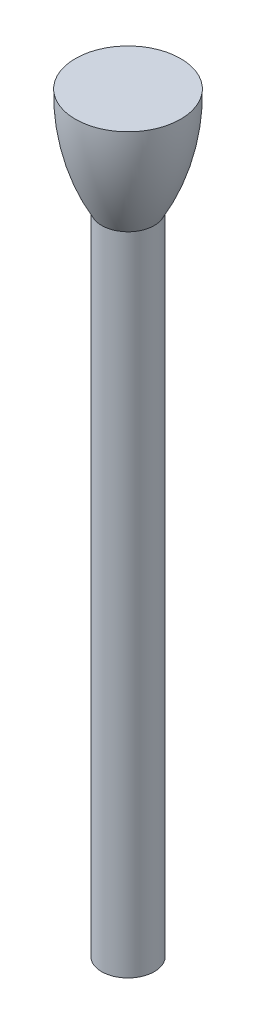
ISO-10303-21;
HEADER;
FILE_DESCRIPTION(('STEP AP214'),'2;1');
FILE_NAME('part.step','',(''),(''),'','','');
FILE_SCHEMA(('AUTOMOTIVE_DESIGN { 1 0 10303 214 1 1 1 1 }'));
ENDSEC;
DATA;
#1=APPLICATION_CONTEXT('core data for automotive mechanical design processes');
#2=APPLICATION_PROTOCOL_DEFINITION('international standard','automotive_design',2000,#1);
#3=PRODUCT_CONTEXT('',#1,'mechanical');
#4=PRODUCT('Part','Part','',(#3));
#5=PRODUCT_RELATED_PRODUCT_CATEGORY('part','',(#4));
#6=PRODUCT_DEFINITION_FORMATION('','',#4);
#7=PRODUCT_DEFINITION_CONTEXT('part definition',#1,'design');
#8=PRODUCT_DEFINITION('design','',#6,#7);
#9=PRODUCT_DEFINITION_SHAPE('','',#8);
#10=(LENGTH_UNIT() NAMED_UNIT(*) SI_UNIT(.MILLI.,.METRE.));
#11=(NAMED_UNIT(*) PLANE_ANGLE_UNIT() SI_UNIT($,.RADIAN.));
#12=(NAMED_UNIT(*) SI_UNIT($,.STERADIAN.) SOLID_ANGLE_UNIT());
#13=UNCERTAINTY_MEASURE_WITH_UNIT(LENGTH_MEASURE(1.E-05),#10,'distance_accuracy_value','');
#14=(GEOMETRIC_REPRESENTATION_CONTEXT(3) GLOBAL_UNCERTAINTY_ASSIGNED_CONTEXT((#13)) GLOBAL_UNIT_ASSIGNED_CONTEXT((#10,
#11,#12)) REPRESENTATION_CONTEXT('',''));
#15=CARTESIAN_POINT('',(0.,0.,0.));
#16=DIRECTION('',(0.,0.,1.));
#17=DIRECTION('',(1.,0.,0.));
#18=AXIS2_PLACEMENT_3D('',#15,#16,#17);
#19=CARTESIAN_POINT('',(0.,136.525,0.));
#20=DIRECTION('',(0.,-1.,0.));
#21=DIRECTION('',(0.,0.,-1.));
#22=AXIS2_PLACEMENT_3D('',#19,#20,#21);
#23=CYLINDRICAL_SURFACE('',#22,11.1125);
#24=CARTESIAN_POINT('',(0.,136.525,0.));
#25=DIRECTION('',(0.,1.,0.));
#26=DIRECTION('',(0.,0.,1.));
#27=AXIS2_PLACEMENT_3D('',#24,#25,#26);
#28=CIRCLE('',#27,11.1125);
#29=CARTESIAN_POINT('',(0.,136.525,11.1125));
#30=VERTEX_POINT('',#29);
#31=EDGE_CURVE('E10',#30,#30,#28,.T.);
#32=ORIENTED_EDGE('',*,*,#31,.F.);
#33=EDGE_LOOP('',(#32));
#34=FACE_BOUND('',#33,.T.);
#35=CARTESIAN_POINT('',(0.,-136.525,0.));
#36=DIRECTION('',(0.,1.,0.));
#37=DIRECTION('',(0.,0.,1.));
#38=AXIS2_PLACEMENT_3D('',#35,#36,#37);
#39=CIRCLE('',#38,11.1125);
#40=CARTESIAN_POINT('',(0.,-136.525,11.1125));
#41=VERTEX_POINT('',#40);
#42=EDGE_CURVE('E33',#41,#41,#39,.T.);
#43=ORIENTED_EDGE('',*,*,#42,.T.);
#44=EDGE_LOOP('',(#43));
#45=FACE_BOUND('',#44,.T.);
#46=ADVANCED_FACE('F30',(#34,#45),#23,.T.);
#47=CARTESIAN_POINT('',(0.,-136.525,0.));
#48=DIRECTION('',(0.,1.,0.));
#49=DIRECTION('',(0.,0.,1.));
#50=AXIS2_PLACEMENT_3D('',#47,#48,#49);
#51=PLANE('',#50);
#52=ORIENTED_EDGE('',*,*,#42,.F.);
#53=EDGE_LOOP('',(#52));
#54=FACE_BOUND('',#53,.T.);
#55=ADVANCED_FACE('F49',(#54),#51,.F.);
#56=CARTESIAN_POINT('',(0.,180.975,0.));
#57=DIRECTION('',(0.,-1.,0.));
#58=DIRECTION('',(0.,0.,-1.));
#59=AXIS2_PLACEMENT_3D('',#56,#57,#58);
#60=PLANE('',#59);
#61=CARTESIAN_POINT('',(0.,180.975,0.));
#62=DIRECTION('',(0.,-1.,0.));
#63=DIRECTION('',(0.,0.,-1.));
#64=AXIS2_PLACEMENT_3D('',#61,#62,#63);
#65=CIRCLE('',#64,22.225);
#66=CARTESIAN_POINT('',(0.,180.975,-22.225));
#67=VERTEX_POINT('',#66);
#68=EDGE_CURVE('E40',#67,#67,#65,.T.);
#69=ORIENTED_EDGE('',*,*,#68,.F.);
#70=EDGE_LOOP('',(#69));
#71=FACE_BOUND('',#70,.T.);
#72=ADVANCED_FACE('F47',(#71),#60,.F.);
#73=CARTESIAN_POINT('',(0.,179.381950090643,0.));
#74=DIRECTION('',(0.,-1.,0.));
#75=DIRECTION('',(0.,0.,-1.));
#76=AXIS2_PLACEMENT_3D('',#73,#74,#75);
#77=DEGENERATE_TOROIDAL_SURFACE('',#76,65.8590503625728,88.0984547894568,.F.);
#78=ORIENTED_EDGE('',*,*,#31,.T.);
#79=EDGE_LOOP('',(#78));
#80=FACE_BOUND('',#79,.T.);
#81=ORIENTED_EDGE('',*,*,#68,.T.);
#82=EDGE_LOOP('',(#81));
#83=FACE_BOUND('',#82,.T.);
#84=ADVANCED_FACE('F45',(#80,#83),#77,.F.);
#85=CLOSED_SHELL('',(#46,#55,#72,#84));
#86=MANIFOLD_SOLID_BREP('B2',#85);
#87=ADVANCED_BREP_SHAPE_REPRESENTATION('',(#18,#86),#14);
#88=SHAPE_DEFINITION_REPRESENTATION(#9,#87);
ENDSEC;
END-ISO-10303-21;
